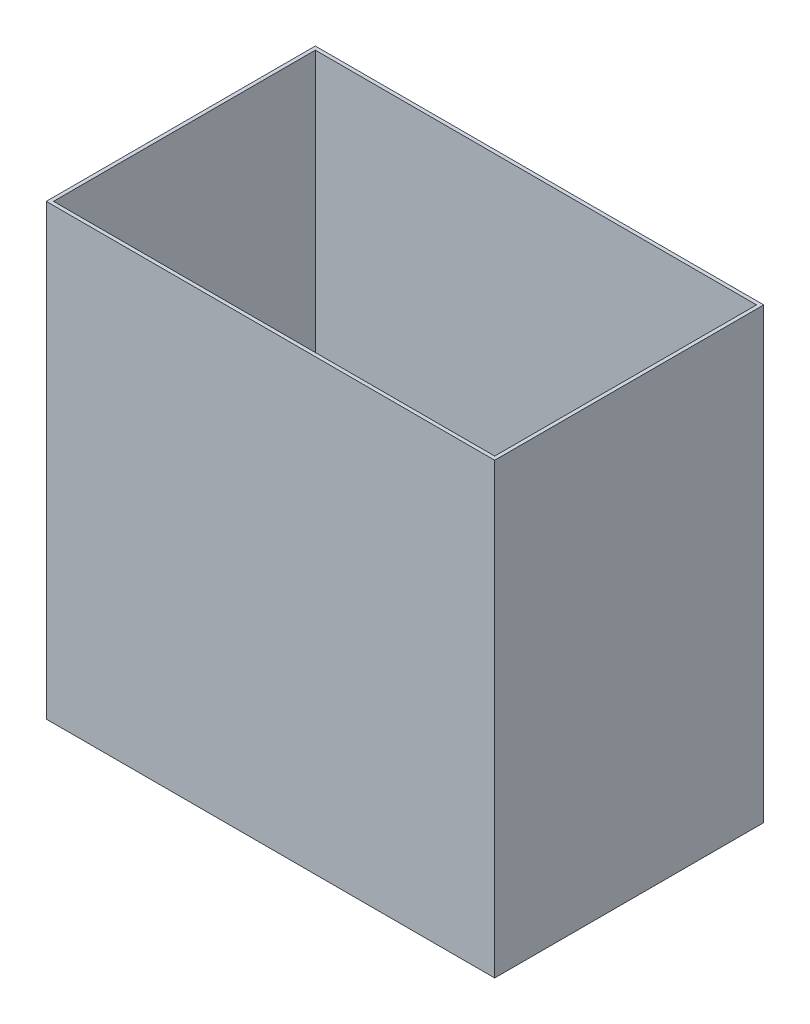
ISO-10303-21;
HEADER;
FILE_DESCRIPTION(('STEP AP214'),'2;1');
FILE_NAME('part.step','',(''),(''),'','','');
FILE_SCHEMA(('AUTOMOTIVE_DESIGN { 1 0 10303 214 1 1 1 1 }'));
ENDSEC;
DATA;
#1=APPLICATION_CONTEXT('core data for automotive mechanical design processes');
#2=APPLICATION_PROTOCOL_DEFINITION('international standard','automotive_design',2000,#1);
#3=PRODUCT_CONTEXT('',#1,'mechanical');
#4=PRODUCT('Part','Part','',(#3));
#5=PRODUCT_RELATED_PRODUCT_CATEGORY('part','',(#4));
#6=PRODUCT_DEFINITION_FORMATION('','',#4);
#7=PRODUCT_DEFINITION_CONTEXT('part definition',#1,'design');
#8=PRODUCT_DEFINITION('design','',#6,#7);
#9=PRODUCT_DEFINITION_SHAPE('','',#8);
#10=(LENGTH_UNIT() NAMED_UNIT(*) SI_UNIT(.MILLI.,.METRE.));
#11=(NAMED_UNIT(*) PLANE_ANGLE_UNIT() SI_UNIT($,.RADIAN.));
#12=(NAMED_UNIT(*) SI_UNIT($,.STERADIAN.) SOLID_ANGLE_UNIT());
#13=UNCERTAINTY_MEASURE_WITH_UNIT(LENGTH_MEASURE(1.E-05),#10,'distance_accuracy_value','');
#14=(GEOMETRIC_REPRESENTATION_CONTEXT(3) GLOBAL_UNCERTAINTY_ASSIGNED_CONTEXT((#13)) GLOBAL_UNIT_ASSIGNED_CONTEXT((#10,
#11,#12)) REPRESENTATION_CONTEXT('',''));
#15=CARTESIAN_POINT('',(0.,0.,0.));
#16=DIRECTION('',(0.,0.,1.));
#17=DIRECTION('',(1.,0.,0.));
#18=AXIS2_PLACEMENT_3D('',#15,#16,#17);
#19=CARTESIAN_POINT('',(0.,0.,150.));
#20=DIRECTION('',(1.,0.,0.));
#21=DIRECTION('',(0.,0.,-1.));
#22=AXIS2_PLACEMENT_3D('',#19,#20,#21);
#23=PLANE('',#22);
#24=DIRECTION('',(0.,-1.,0.));
#25=VECTOR('',#24,1.);
#26=CARTESIAN_POINT('',(0.,0.,0.));
#27=LINE('',#26,#25);
#28=CARTESIAN_POINT('',(0.,250.,0.));
#29=VERTEX_POINT('',#28);
#30=CARTESIAN_POINT('',(0.,0.,0.));
#31=VERTEX_POINT('',#30);
#32=EDGE_CURVE('E144',#29,#31,#27,.T.);
#33=ORIENTED_EDGE('',*,*,#32,.T.);
#34=DIRECTION('',(0.,0.,-1.));
#35=VECTOR('',#34,1.);
#36=CARTESIAN_POINT('',(0.,0.,150.));
#37=LINE('',#36,#35);
#38=CARTESIAN_POINT('',(0.,0.,150.));
#39=VERTEX_POINT('',#38);
#40=EDGE_CURVE('E11',#39,#31,#37,.T.);
#41=ORIENTED_EDGE('',*,*,#40,.F.);
#42=DIRECTION('',(0.,-1.,0.));
#43=VECTOR('',#42,1.);
#44=CARTESIAN_POINT('',(0.,0.,150.));
#45=LINE('',#44,#43);
#46=CARTESIAN_POINT('',(0.,250.,150.));
#47=VERTEX_POINT('',#46);
#48=EDGE_CURVE('E148',#47,#39,#45,.T.);
#49=ORIENTED_EDGE('',*,*,#48,.F.);
#50=DIRECTION('',(0.,0.,-1.));
#51=VECTOR('',#50,1.);
#52=CARTESIAN_POINT('',(0.,250.,150.));
#53=LINE('',#52,#51);
#54=EDGE_CURVE('E154',#47,#29,#53,.T.);
#55=ORIENTED_EDGE('',*,*,#54,.T.);
#56=EDGE_LOOP('',(#33,#41,#49,#55));
#57=FACE_BOUND('',#56,.T.);
#58=ADVANCED_FACE('F36',(#57),#23,.F.);
#59=CARTESIAN_POINT('',(0.,0.,150.));
#60=DIRECTION('',(0.,1.,0.));
#61=DIRECTION('',(0.,0.,1.));
#62=AXIS2_PLACEMENT_3D('',#59,#60,#61);
#63=PLANE('',#62);
#64=DIRECTION('',(1.,0.,0.));
#65=VECTOR('',#64,1.);
#66=CARTESIAN_POINT('',(0.,0.,0.));
#67=LINE('',#66,#65);
#68=CARTESIAN_POINT('',(250.,0.,0.));
#69=VERTEX_POINT('',#68);
#70=EDGE_CURVE('E157',#31,#69,#67,.T.);
#71=ORIENTED_EDGE('',*,*,#70,.T.);
#72=DIRECTION('',(0.,0.,-1.));
#73=VECTOR('',#72,1.);
#74=CARTESIAN_POINT('',(250.,0.,150.));
#75=LINE('',#74,#73);
#76=CARTESIAN_POINT('',(250.,0.,150.));
#77=VERTEX_POINT('',#76);
#78=EDGE_CURVE('E43',#77,#69,#75,.T.);
#79=ORIENTED_EDGE('',*,*,#78,.F.);
#80=DIRECTION('',(1.,0.,0.));
#81=VECTOR('',#80,1.);
#82=CARTESIAN_POINT('',(0.,0.,150.));
#83=LINE('',#82,#81);
#84=EDGE_CURVE('E87',#39,#77,#83,.T.);
#85=ORIENTED_EDGE('',*,*,#84,.F.);
#86=ORIENTED_EDGE('',*,*,#40,.T.);
#87=EDGE_LOOP('',(#71,#79,#85,#86));
#88=FACE_BOUND('',#87,.T.);
#89=ADVANCED_FACE('F186',(#88),#63,.F.);
#90=CARTESIAN_POINT('',(250.,0.,150.));
#91=DIRECTION('',(-1.,0.,0.));
#92=DIRECTION('',(0.,0.,1.));
#93=AXIS2_PLACEMENT_3D('',#90,#91,#92);
#94=PLANE('',#93);
#95=DIRECTION('',(0.,1.,0.));
#96=VECTOR('',#95,1.);
#97=CARTESIAN_POINT('',(250.,0.,0.));
#98=LINE('',#97,#96);
#99=CARTESIAN_POINT('',(250.,250.,0.));
#100=VERTEX_POINT('',#99);
#101=EDGE_CURVE('E159',#69,#100,#98,.T.);
#102=ORIENTED_EDGE('',*,*,#101,.T.);
#103=DIRECTION('',(0.,0.,-1.));
#104=VECTOR('',#103,1.);
#105=CARTESIAN_POINT('',(250.,250.,150.));
#106=LINE('',#105,#104);
#107=CARTESIAN_POINT('',(250.,250.,150.));
#108=VERTEX_POINT('',#107);
#109=EDGE_CURVE('E163',#108,#100,#106,.T.);
#110=ORIENTED_EDGE('',*,*,#109,.F.);
#111=DIRECTION('',(0.,1.,0.));
#112=VECTOR('',#111,1.);
#113=CARTESIAN_POINT('',(250.,0.,150.));
#114=LINE('',#113,#112);
#115=EDGE_CURVE('E151',#77,#108,#114,.T.);
#116=ORIENTED_EDGE('',*,*,#115,.F.);
#117=ORIENTED_EDGE('',*,*,#78,.T.);
#118=EDGE_LOOP('',(#102,#110,#116,#117));
#119=FACE_BOUND('',#118,.T.);
#120=ADVANCED_FACE('F168',(#119),#94,.F.);
#121=CARTESIAN_POINT('',(0.,250.,150.));
#122=DIRECTION('',(0.,-1.,0.));
#123=DIRECTION('',(0.,0.,-1.));
#124=AXIS2_PLACEMENT_3D('',#121,#122,#123);
#125=PLANE('',#124);
#126=DIRECTION('',(0.,0.,-1.));
#127=VECTOR('',#126,1.);
#128=CARTESIAN_POINT('',(248.,250.,150.));
#129=LINE('',#128,#127);
#130=CARTESIAN_POINT('',(248.,250.,148.));
#131=VERTEX_POINT('',#130);
#132=CARTESIAN_POINT('',(248.,250.,2.));
#133=VERTEX_POINT('',#132);
#134=EDGE_CURVE('E138',#131,#133,#129,.T.);
#135=ORIENTED_EDGE('',*,*,#134,.F.);
#136=DIRECTION('',(1.,0.,0.));
#137=VECTOR('',#136,1.);
#138=CARTESIAN_POINT('',(0.,250.,148.));
#139=LINE('',#138,#137);
#140=CARTESIAN_POINT('',(2.,250.,148.));
#141=VERTEX_POINT('',#140);
#142=EDGE_CURVE('E50',#141,#131,#139,.T.);
#143=ORIENTED_EDGE('',*,*,#142,.F.);
#144=DIRECTION('',(0.,0.,1.));
#145=VECTOR('',#144,1.);
#146=CARTESIAN_POINT('',(2.,250.,150.));
#147=LINE('',#146,#145);
#148=CARTESIAN_POINT('',(2.,250.,2.));
#149=VERTEX_POINT('',#148);
#150=EDGE_CURVE('E129',#149,#141,#147,.T.);
#151=ORIENTED_EDGE('',*,*,#150,.F.);
#152=DIRECTION('',(-1.,0.,0.));
#153=VECTOR('',#152,1.);
#154=CARTESIAN_POINT('',(0.,250.,2.));
#155=LINE('',#154,#153);
#156=EDGE_CURVE('E132',#133,#149,#155,.T.);
#157=ORIENTED_EDGE('',*,*,#156,.F.);
#158=EDGE_LOOP('',(#135,#143,#151,#157));
#159=FACE_BOUND('',#158,.T.);
#160=DIRECTION('',(-1.,0.,0.));
#161=VECTOR('',#160,1.);
#162=CARTESIAN_POINT('',(0.,250.,0.));
#163=LINE('',#162,#161);
#164=EDGE_CURVE('E80',#100,#29,#163,.T.);
#165=ORIENTED_EDGE('',*,*,#164,.T.);
#166=ORIENTED_EDGE('',*,*,#54,.F.);
#167=DIRECTION('',(-1.,0.,0.));
#168=VECTOR('',#167,1.);
#169=CARTESIAN_POINT('',(0.,250.,150.));
#170=LINE('',#169,#168);
#171=EDGE_CURVE('E59',#108,#47,#170,.T.);
#172=ORIENTED_EDGE('',*,*,#171,.F.);
#173=ORIENTED_EDGE('',*,*,#109,.T.);
#174=EDGE_LOOP('',(#165,#166,#172,#173));
#175=FACE_BOUND('',#174,.T.);
#176=ADVANCED_FACE('F176',(#159,#175),#125,.F.);
#177=CARTESIAN_POINT('',(0.,0.,150.));
#178=DIRECTION('',(0.,0.,-1.));
#179=DIRECTION('',(-1.,0.,0.));
#180=AXIS2_PLACEMENT_3D('',#177,#178,#179);
#181=PLANE('',#180);
#182=ORIENTED_EDGE('',*,*,#48,.T.);
#183=ORIENTED_EDGE('',*,*,#84,.T.);
#184=ORIENTED_EDGE('',*,*,#115,.T.);
#185=ORIENTED_EDGE('',*,*,#171,.T.);
#186=EDGE_LOOP('',(#182,#183,#184,#185));
#187=FACE_BOUND('',#186,.T.);
#188=ADVANCED_FACE('F178',(#187),#181,.F.);
#189=CARTESIAN_POINT('',(0.,0.,0.));
#190=DIRECTION('',(0.,0.,-1.));
#191=DIRECTION('',(-1.,0.,0.));
#192=AXIS2_PLACEMENT_3D('',#189,#190,#191);
#193=PLANE('',#192);
#194=ORIENTED_EDGE('',*,*,#32,.F.);
#195=ORIENTED_EDGE('',*,*,#164,.F.);
#196=ORIENTED_EDGE('',*,*,#101,.F.);
#197=ORIENTED_EDGE('',*,*,#70,.F.);
#198=EDGE_LOOP('',(#194,#195,#196,#197));
#199=FACE_BOUND('',#198,.T.);
#200=ADVANCED_FACE('F172',(#199),#193,.T.);
#201=CARTESIAN_POINT('',(0.,2.,148.));
#202=DIRECTION('',(0.,0.,1.));
#203=DIRECTION('',(1.,0.,0.));
#204=AXIS2_PLACEMENT_3D('',#201,#202,#203);
#205=PLANE('',#204);
#206=ORIENTED_EDGE('',*,*,#142,.T.);
#207=DIRECTION('',(0.,1.,0.));
#208=VECTOR('',#207,1.);
#209=CARTESIAN_POINT('',(248.,2.,148.));
#210=LINE('',#209,#208);
#211=CARTESIAN_POINT('',(248.,2.,148.));
#212=VERTEX_POINT('',#211);
#213=EDGE_CURVE('E107',#212,#131,#210,.T.);
#214=ORIENTED_EDGE('',*,*,#213,.F.);
#215=DIRECTION('',(1.,0.,0.));
#216=VECTOR('',#215,1.);
#217=CARTESIAN_POINT('',(0.,2.,148.));
#218=LINE('',#217,#216);
#219=CARTESIAN_POINT('',(2.,2.,148.));
#220=VERTEX_POINT('',#219);
#221=EDGE_CURVE('E111',#220,#212,#218,.T.);
#222=ORIENTED_EDGE('',*,*,#221,.F.);
#223=DIRECTION('',(0.,1.,0.));
#224=VECTOR('',#223,1.);
#225=CARTESIAN_POINT('',(2.,2.,148.));
#226=LINE('',#225,#224);
#227=EDGE_CURVE('E142',#220,#141,#226,.T.);
#228=ORIENTED_EDGE('',*,*,#227,.T.);
#229=EDGE_LOOP('',(#206,#214,#222,#228));
#230=FACE_BOUND('',#229,.T.);
#231=ADVANCED_FACE('F109',(#230),#205,.F.);
#232=CARTESIAN_POINT('',(2.,2.,150.));
#233=DIRECTION('',(-1.,0.,0.));
#234=DIRECTION('',(0.,0.,1.));
#235=AXIS2_PLACEMENT_3D('',#232,#233,#234);
#236=PLANE('',#235);
#237=ORIENTED_EDGE('',*,*,#150,.T.);
#238=ORIENTED_EDGE('',*,*,#227,.F.);
#239=DIRECTION('',(0.,0.,1.));
#240=VECTOR('',#239,1.);
#241=CARTESIAN_POINT('',(2.,2.,150.));
#242=LINE('',#241,#240);
#243=CARTESIAN_POINT('',(2.,2.,2.));
#244=VERTEX_POINT('',#243);
#245=EDGE_CURVE('E117',#244,#220,#242,.T.);
#246=ORIENTED_EDGE('',*,*,#245,.F.);
#247=DIRECTION('',(0.,1.,0.));
#248=VECTOR('',#247,1.);
#249=CARTESIAN_POINT('',(2.,2.,2.));
#250=LINE('',#249,#248);
#251=EDGE_CURVE('E145',#244,#149,#250,.T.);
#252=ORIENTED_EDGE('',*,*,#251,.T.);
#253=EDGE_LOOP('',(#237,#238,#246,#252));
#254=FACE_BOUND('',#253,.T.);
#255=ADVANCED_FACE('F226',(#254),#236,.F.);
#256=CARTESIAN_POINT('',(0.,2.,2.));
#257=DIRECTION('',(0.,0.,-1.));
#258=DIRECTION('',(-1.,0.,0.));
#259=AXIS2_PLACEMENT_3D('',#256,#257,#258);
#260=PLANE('',#259);
#261=ORIENTED_EDGE('',*,*,#156,.T.);
#262=ORIENTED_EDGE('',*,*,#251,.F.);
#263=DIRECTION('',(-1.,0.,0.));
#264=VECTOR('',#263,1.);
#265=CARTESIAN_POINT('',(0.,2.,2.));
#266=LINE('',#265,#264);
#267=CARTESIAN_POINT('',(248.,2.,2.));
#268=VERTEX_POINT('',#267);
#269=EDGE_CURVE('E125',#268,#244,#266,.T.);
#270=ORIENTED_EDGE('',*,*,#269,.F.);
#271=DIRECTION('',(0.,1.,0.));
#272=VECTOR('',#271,1.);
#273=CARTESIAN_POINT('',(248.,2.,2.));
#274=LINE('',#273,#272);
#275=EDGE_CURVE('E116',#268,#133,#274,.T.);
#276=ORIENTED_EDGE('',*,*,#275,.T.);
#277=EDGE_LOOP('',(#261,#262,#270,#276));
#278=FACE_BOUND('',#277,.T.);
#279=ADVANCED_FACE('F235',(#278),#260,.F.);
#280=CARTESIAN_POINT('',(248.,2.,150.));
#281=DIRECTION('',(1.,0.,0.));
#282=DIRECTION('',(0.,0.,-1.));
#283=AXIS2_PLACEMENT_3D('',#280,#281,#282);
#284=PLANE('',#283);
#285=ORIENTED_EDGE('',*,*,#134,.T.);
#286=ORIENTED_EDGE('',*,*,#275,.F.);
#287=DIRECTION('',(0.,0.,-1.));
#288=VECTOR('',#287,1.);
#289=CARTESIAN_POINT('',(248.,2.,150.));
#290=LINE('',#289,#288);
#291=EDGE_CURVE('E120',#212,#268,#290,.T.);
#292=ORIENTED_EDGE('',*,*,#291,.F.);
#293=ORIENTED_EDGE('',*,*,#213,.T.);
#294=EDGE_LOOP('',(#285,#286,#292,#293));
#295=FACE_BOUND('',#294,.T.);
#296=ADVANCED_FACE('F121',(#295),#284,.F.);
#297=CARTESIAN_POINT('',(0.,2.,0.));
#298=DIRECTION('',(0.,1.,0.));
#299=DIRECTION('',(0.,0.,1.));
#300=AXIS2_PLACEMENT_3D('',#297,#298,#299);
#301=PLANE('',#300);
#302=ORIENTED_EDGE('',*,*,#221,.T.);
#303=ORIENTED_EDGE('',*,*,#291,.T.);
#304=ORIENTED_EDGE('',*,*,#269,.T.);
#305=ORIENTED_EDGE('',*,*,#245,.T.);
#306=EDGE_LOOP('',(#302,#303,#304,#305));
#307=FACE_BOUND('',#306,.T.);
#308=ADVANCED_FACE('F127',(#307),#301,.T.);
#309=CLOSED_SHELL('',(#58,#89,#120,#176,#188,#200,#231,#255,#279,#296,#308));
#310=MANIFOLD_SOLID_BREP('B2',#309);
#311=ADVANCED_BREP_SHAPE_REPRESENTATION('',(#18,#310),#14);
#312=SHAPE_DEFINITION_REPRESENTATION(#9,#311);
ENDSEC;
END-ISO-10303-21;
